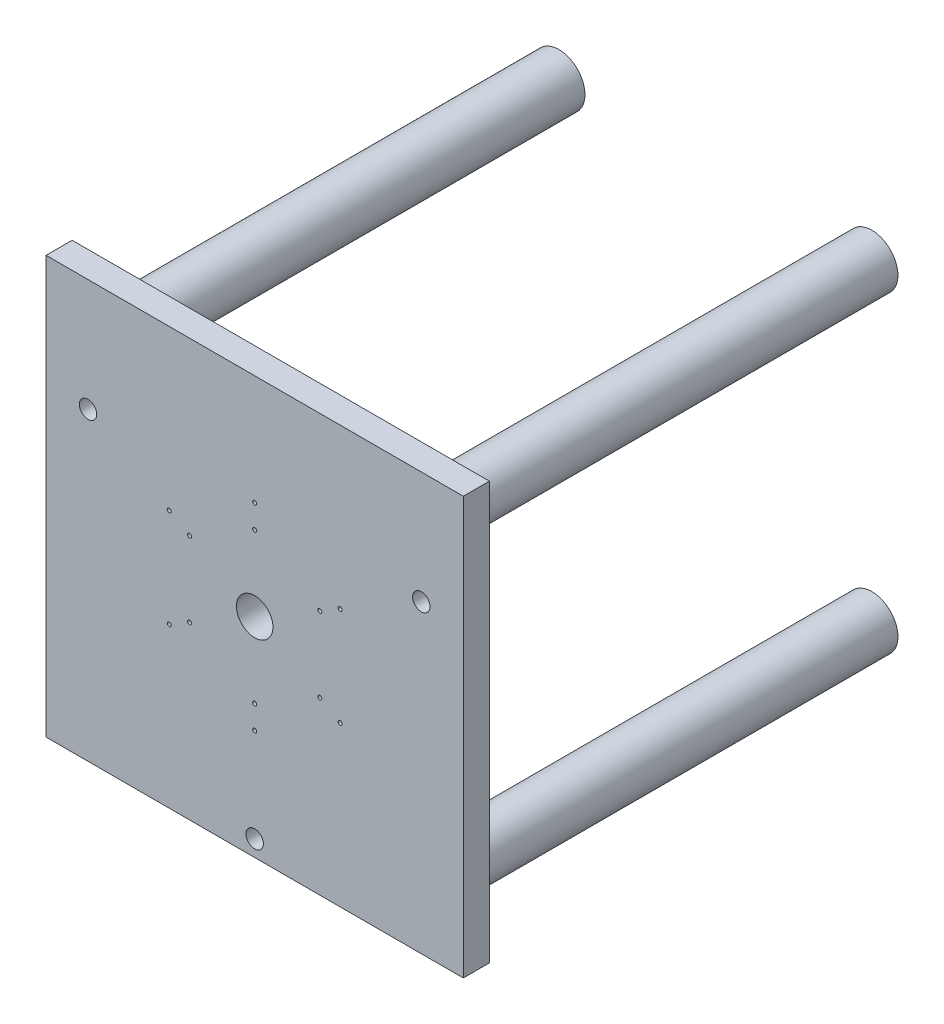
ISO-10303-21;
HEADER;
FILE_DESCRIPTION(('STEP AP214'),'2;1');
FILE_NAME('part.step','',(''),(''),'','','');
FILE_SCHEMA(('AUTOMOTIVE_DESIGN { 1 0 10303 214 1 1 1 1 }'));
ENDSEC;
DATA;
#1=APPLICATION_CONTEXT('core data for automotive mechanical design processes');
#2=APPLICATION_PROTOCOL_DEFINITION('international standard','automotive_design',2000,#1);
#3=PRODUCT_CONTEXT('',#1,'mechanical');
#4=PRODUCT('Part','Part','',(#3));
#5=PRODUCT_RELATED_PRODUCT_CATEGORY('part','',(#4));
#6=PRODUCT_DEFINITION_FORMATION('','',#4);
#7=PRODUCT_DEFINITION_CONTEXT('part definition',#1,'design');
#8=PRODUCT_DEFINITION('design','',#6,#7);
#9=PRODUCT_DEFINITION_SHAPE('','',#8);
#10=(LENGTH_UNIT() NAMED_UNIT(*) SI_UNIT(.MILLI.,.METRE.));
#11=(NAMED_UNIT(*) PLANE_ANGLE_UNIT() SI_UNIT($,.RADIAN.));
#12=(NAMED_UNIT(*) SI_UNIT($,.STERADIAN.) SOLID_ANGLE_UNIT());
#13=UNCERTAINTY_MEASURE_WITH_UNIT(LENGTH_MEASURE(1.E-05),#10,'distance_accuracy_value','');
#14=(GEOMETRIC_REPRESENTATION_CONTEXT(3) GLOBAL_UNCERTAINTY_ASSIGNED_CONTEXT((#13)) GLOBAL_UNIT_ASSIGNED_CONTEXT((#10,
#11,#12)) REPRESENTATION_CONTEXT('',''));
#15=CARTESIAN_POINT('',(0.,0.,0.));
#16=DIRECTION('',(0.,0.,1.));
#17=DIRECTION('',(1.,0.,0.));
#18=AXIS2_PLACEMENT_3D('',#15,#16,#17);
#19=CARTESIAN_POINT('',(0.,0.,15.));
#20=DIRECTION('',(0.,0.,1.));
#21=DIRECTION('',(1.,0.,0.));
#22=AXIS2_PLACEMENT_3D('',#19,#20,#21);
#23=PLANE('',#22);
#24=CARTESIAN_POINT('',(0.,-110.68,15.));
#25=DIRECTION('',(0.,0.,1.));
#26=DIRECTION('',(1.,0.,0.));
#27=AXIS2_PLACEMENT_3D('',#24,#25,#26);
#28=CIRCLE('',#27,5.);
#29=CARTESIAN_POINT('',(5.00000000000002,-110.68,15.));
#30=VERTEX_POINT('',#29);
#31=EDGE_CURVE('E200',#30,#30,#28,.T.);
#32=ORIENTED_EDGE('',*,*,#31,.F.);
#33=EDGE_LOOP('',(#32));
#34=FACE_BOUND('',#33,.T.);
#35=CARTESIAN_POINT('',(-95.8516916908614,55.3400000000004,15.));
#36=DIRECTION('',(0.,0.,1.));
#37=DIRECTION('',(1.,0.,0.));
#38=AXIS2_PLACEMENT_3D('',#35,#36,#37);
#39=CIRCLE('',#38,5.00000000000001);
#40=CARTESIAN_POINT('',(-90.8516916908614,55.3400000000004,15.));
#41=VERTEX_POINT('',#40);
#42=EDGE_CURVE('E683',#41,#41,#39,.T.);
#43=ORIENTED_EDGE('',*,*,#42,.F.);
#44=EDGE_LOOP('',(#43));
#45=FACE_BOUND('',#44,.T.);
#46=CARTESIAN_POINT('',(95.8516916908614,55.3400000000005,15.));
#47=DIRECTION('',(0.,0.,1.));
#48=DIRECTION('',(1.,0.,0.));
#49=AXIS2_PLACEMENT_3D('',#46,#47,#48);
#50=CIRCLE('',#49,5.00000000000001);
#51=CARTESIAN_POINT('',(100.851691690861,55.3400000000005,15.));
#52=VERTEX_POINT('',#51);
#53=EDGE_CURVE('E687',#52,#52,#50,.T.);
#54=ORIENTED_EDGE('',*,*,#53,.F.);
#55=EDGE_LOOP('',(#54));
#56=FACE_BOUND('',#55,.T.);
#57=CARTESIAN_POINT('',(-49.1469416647659,28.3750000000008,15.));
#58=DIRECTION('',(0.,0.,-1.));
#59=DIRECTION('',(-1.,0.,0.));
#60=AXIS2_PLACEMENT_3D('',#57,#58,#59);
#61=CIRCLE('',#60,1.15000000000001);
#62=CARTESIAN_POINT('',(-50.2969416647659,28.3750000000008,15.));
#63=VERTEX_POINT('',#62);
#64=EDGE_CURVE('E207',#63,#63,#61,.T.);
#65=ORIENTED_EDGE('',*,*,#64,.T.);
#66=EDGE_LOOP('',(#65));
#67=FACE_BOUND('',#66,.T.);
#68=CARTESIAN_POINT('',(-37.4555987136761,-21.6250000000006,15.));
#69=DIRECTION('',(0.,0.,1.));
#70=DIRECTION('',(-1.,0.,0.));
#71=AXIS2_PLACEMENT_3D('',#68,#69,#70);
#72=CIRCLE('',#71,1.15);
#73=CARTESIAN_POINT('',(-38.6055987136761,-21.6250000000006,15.));
#74=VERTEX_POINT('',#73);
#75=EDGE_CURVE('E181',#74,#74,#72,.T.);
#76=ORIENTED_EDGE('',*,*,#75,.F.);
#77=EDGE_LOOP('',(#76));
#78=FACE_BOUND('',#77,.T.);
#79=CARTESIAN_POINT('',(-49.1469416647659,-28.3750000000008,15.));
#80=DIRECTION('',(0.,0.,1.));
#81=DIRECTION('',(-1.,0.,0.));
#82=AXIS2_PLACEMENT_3D('',#79,#80,#81);
#83=CIRCLE('',#82,1.15000000000001);
#84=CARTESIAN_POINT('',(-50.2969416647659,-28.3750000000008,15.));
#85=VERTEX_POINT('',#84);
#86=EDGE_CURVE('E195',#85,#85,#83,.T.);
#87=ORIENTED_EDGE('',*,*,#86,.F.);
#88=EDGE_LOOP('',(#87));
#89=FACE_BOUND('',#88,.T.);
#90=CARTESIAN_POINT('',(37.4555987136761,-21.6250000000006,15.));
#91=DIRECTION('',(0.,0.,-1.));
#92=DIRECTION('',(1.,0.,0.));
#93=AXIS2_PLACEMENT_3D('',#90,#91,#92);
#94=CIRCLE('',#93,1.15);
#95=CARTESIAN_POINT('',(38.6055987136761,-21.6250000000006,15.));
#96=VERTEX_POINT('',#95);
#97=EDGE_CURVE('E163',#96,#96,#94,.T.);
#98=ORIENTED_EDGE('',*,*,#97,.T.);
#99=EDGE_LOOP('',(#98));
#100=FACE_BOUND('',#99,.T.);
#101=CARTESIAN_POINT('',(49.1469416647659,-28.3750000000008,15.));
#102=DIRECTION('',(0.,0.,-1.));
#103=DIRECTION('',(1.,0.,0.));
#104=AXIS2_PLACEMENT_3D('',#101,#102,#103);
#105=CIRCLE('',#104,1.15000000000001);
#106=CARTESIAN_POINT('',(50.2969416647659,-28.3750000000008,15.));
#107=VERTEX_POINT('',#106);
#108=EDGE_CURVE('E229',#107,#107,#105,.T.);
#109=ORIENTED_EDGE('',*,*,#108,.T.);
#110=EDGE_LOOP('',(#109));
#111=FACE_BOUND('',#110,.T.);
#112=CARTESIAN_POINT('',(-9.2433005693948E-13,-43.2499999999995,15.));
#113=DIRECTION('',(0.,0.,-1.));
#114=DIRECTION('',(1.,0.,0.));
#115=AXIS2_PLACEMENT_3D('',#112,#113,#114);
#116=CIRCLE('',#115,1.14999999999999);
#117=CARTESIAN_POINT('',(1.14999999999906,-43.2499999999995,15.));
#118=VERTEX_POINT('',#117);
#119=EDGE_CURVE('E233',#118,#118,#116,.T.);
#120=ORIENTED_EDGE('',*,*,#119,.T.);
#121=EDGE_LOOP('',(#120));
#122=FACE_BOUND('',#121,.T.);
#123=CARTESIAN_POINT('',(-1.21284926546395E-12,-56.7499999999995,15.));
#124=DIRECTION('',(0.,0.,-1.));
#125=DIRECTION('',(1.,0.,0.));
#126=AXIS2_PLACEMENT_3D('',#123,#124,#125);
#127=CIRCLE('',#126,1.15);
#128=CARTESIAN_POINT('',(1.14999999999878,-56.7499999999995,15.));
#129=VERTEX_POINT('',#128);
#130=EDGE_CURVE('E185',#129,#129,#127,.T.);
#131=ORIENTED_EDGE('',*,*,#130,.T.);
#132=EDGE_LOOP('',(#131));
#133=FACE_BOUND('',#132,.T.);
#134=CARTESIAN_POINT('',(37.4555987136761,21.6250000000006,15.));
#135=DIRECTION('',(0.,0.,1.));
#136=DIRECTION('',(1.,0.,0.));
#137=AXIS2_PLACEMENT_3D('',#134,#135,#136);
#138=CIRCLE('',#137,1.15);
#139=CARTESIAN_POINT('',(38.6055987136761,21.6250000000006,15.));
#140=VERTEX_POINT('',#139);
#141=EDGE_CURVE('E146',#140,#140,#138,.T.);
#142=ORIENTED_EDGE('',*,*,#141,.F.);
#143=EDGE_LOOP('',(#142));
#144=FACE_BOUND('',#143,.T.);
#145=CARTESIAN_POINT('',(49.1469416647659,28.3750000000008,15.));
#146=DIRECTION('',(0.,0.,1.));
#147=DIRECTION('',(1.,0.,0.));
#148=AXIS2_PLACEMENT_3D('',#145,#146,#147);
#149=CIRCLE('',#148,1.15000000000001);
#150=CARTESIAN_POINT('',(50.2969416647659,28.3750000000008,15.));
#151=VERTEX_POINT('',#150);
#152=EDGE_CURVE('E243',#151,#151,#149,.T.);
#153=ORIENTED_EDGE('',*,*,#152,.F.);
#154=EDGE_LOOP('',(#153));
#155=FACE_BOUND('',#154,.T.);
#156=CARTESIAN_POINT('',(-9.2433005693948E-13,43.2499999999995,15.));
#157=DIRECTION('',(0.,0.,1.));
#158=DIRECTION('',(1.,0.,0.));
#159=AXIS2_PLACEMENT_3D('',#156,#157,#158);
#160=CIRCLE('',#159,1.14999999999999);
#161=CARTESIAN_POINT('',(1.14999999999906,43.2499999999995,15.));
#162=VERTEX_POINT('',#161);
#163=EDGE_CURVE('E247',#162,#162,#160,.T.);
#164=ORIENTED_EDGE('',*,*,#163,.F.);
#165=EDGE_LOOP('',(#164));
#166=FACE_BOUND('',#165,.T.);
#167=CARTESIAN_POINT('',(-1.21284926546395E-12,56.7499999999995,15.));
#168=DIRECTION('',(0.,0.,1.));
#169=DIRECTION('',(1.,0.,0.));
#170=AXIS2_PLACEMENT_3D('',#167,#168,#169);
#171=CIRCLE('',#170,1.15);
#172=CARTESIAN_POINT('',(1.14999999999878,56.7499999999995,15.));
#173=VERTEX_POINT('',#172);
#174=EDGE_CURVE('E175',#173,#173,#171,.T.);
#175=ORIENTED_EDGE('',*,*,#174,.F.);
#176=EDGE_LOOP('',(#175));
#177=FACE_BOUND('',#176,.T.);
#178=CARTESIAN_POINT('',(0.,0.,15.));
#179=DIRECTION('',(0.,0.,1.));
#180=DIRECTION('',(1.,0.,0.));
#181=AXIS2_PLACEMENT_3D('',#178,#179,#180);
#182=CIRCLE('',#181,10.5);
#183=CARTESIAN_POINT('',(10.5,0.,15.));
#184=VERTEX_POINT('',#183);
#185=EDGE_CURVE('E140',#184,#184,#182,.T.);
#186=ORIENTED_EDGE('',*,*,#185,.F.);
#187=EDGE_LOOP('',(#186));
#188=FACE_BOUND('',#187,.T.);
#189=DIRECTION('',(0.,1.,0.));
#190=VECTOR('',#189,1.);
#191=CARTESIAN_POINT('',(120.,120.,15.));
#192=LINE('',#191,#190);
#193=CARTESIAN_POINT('',(120.,-120.,15.));
#194=VERTEX_POINT('',#193);
#195=CARTESIAN_POINT('',(120.,120.,15.));
#196=VERTEX_POINT('',#195);
#197=EDGE_CURVE('E96',#194,#196,#192,.T.);
#198=ORIENTED_EDGE('',*,*,#197,.T.);
#199=DIRECTION('',(-1.,0.,0.));
#200=VECTOR('',#199,1.);
#201=CARTESIAN_POINT('',(-120.,120.,15.));
#202=LINE('',#201,#200);
#203=CARTESIAN_POINT('',(-120.,120.,15.));
#204=VERTEX_POINT('',#203);
#205=EDGE_CURVE('E91',#196,#204,#202,.T.);
#206=ORIENTED_EDGE('',*,*,#205,.T.);
#207=DIRECTION('',(0.,-1.,0.));
#208=VECTOR('',#207,1.);
#209=CARTESIAN_POINT('',(-120.,120.,15.));
#210=LINE('',#209,#208);
#211=CARTESIAN_POINT('',(-120.,-120.,15.));
#212=VERTEX_POINT('',#211);
#213=EDGE_CURVE('E94',#204,#212,#210,.T.);
#214=ORIENTED_EDGE('',*,*,#213,.T.);
#215=DIRECTION('',(1.,0.,0.));
#216=VECTOR('',#215,1.);
#217=CARTESIAN_POINT('',(-120.,-120.,15.));
#218=LINE('',#217,#216);
#219=EDGE_CURVE('E60',#212,#194,#218,.T.);
#220=ORIENTED_EDGE('',*,*,#219,.T.);
#221=EDGE_LOOP('',(#198,#206,#214,#220));
#222=FACE_BOUND('',#221,.T.);
#223=CARTESIAN_POINT('',(-37.4555987136761,21.6250000000006,15.));
#224=DIRECTION('',(0.,0.,-1.));
#225=DIRECTION('',(-1.,0.,0.));
#226=AXIS2_PLACEMENT_3D('',#223,#224,#225);
#227=CIRCLE('',#226,1.15);
#228=CARTESIAN_POINT('',(-38.6055987136761,21.6250000000006,15.));
#229=VERTEX_POINT('',#228);
#230=EDGE_CURVE('E191',#229,#229,#227,.T.);
#231=ORIENTED_EDGE('',*,*,#230,.T.);
#232=EDGE_LOOP('',(#231));
#233=FACE_BOUND('',#232,.T.);
#234=ADVANCED_FACE('F40',(#34,#45,#56,#67,#78,#89,#100,#111,#122,#133,#144,#155,#166,#177,#188,
#222,#233),#23,.T.);
#235=CARTESIAN_POINT('',(0.,0.,0.));
#236=DIRECTION('',(0.,0.,1.));
#237=DIRECTION('',(1.,0.,0.));
#238=AXIS2_PLACEMENT_3D('',#235,#236,#237);
#239=PLANE('',#238);
#240=CARTESIAN_POINT('',(0.,-110.68,0.));
#241=DIRECTION('',(0.,0.,1.));
#242=DIRECTION('',(1.,0.,0.));
#243=AXIS2_PLACEMENT_3D('',#240,#241,#242);
#244=CIRCLE('',#243,5.);
#245=CARTESIAN_POINT('',(5.00000000000002,-110.68,0.));
#246=VERTEX_POINT('',#245);
#247=EDGE_CURVE('E44',#246,#246,#244,.T.);
#248=ORIENTED_EDGE('',*,*,#247,.T.);
#249=EDGE_LOOP('',(#248));
#250=FACE_BOUND('',#249,.T.);
#251=CARTESIAN_POINT('',(-95.8516916908614,55.3400000000004,0.));
#252=DIRECTION('',(0.,0.,1.));
#253=DIRECTION('',(1.,0.,0.));
#254=AXIS2_PLACEMENT_3D('',#251,#252,#253);
#255=CIRCLE('',#254,5.00000000000001);
#256=CARTESIAN_POINT('',(-90.8516916908614,55.3400000000004,0.));
#257=VERTEX_POINT('',#256);
#258=EDGE_CURVE('E199',#257,#257,#255,.T.);
#259=ORIENTED_EDGE('',*,*,#258,.T.);
#260=EDGE_LOOP('',(#259));
#261=FACE_BOUND('',#260,.T.);
#262=CARTESIAN_POINT('',(95.8516916908614,55.3400000000005,0.));
#263=DIRECTION('',(0.,0.,1.));
#264=DIRECTION('',(1.,0.,0.));
#265=AXIS2_PLACEMENT_3D('',#262,#263,#264);
#266=CIRCLE('',#265,5.00000000000001);
#267=CARTESIAN_POINT('',(100.851691690861,55.3400000000005,0.));
#268=VERTEX_POINT('',#267);
#269=EDGE_CURVE('E196',#268,#268,#266,.T.);
#270=ORIENTED_EDGE('',*,*,#269,.T.);
#271=EDGE_LOOP('',(#270));
#272=FACE_BOUND('',#271,.T.);
#273=CARTESIAN_POINT('',(-37.4555987136761,-21.6250000000006,0.));
#274=DIRECTION('',(0.,0.,1.));
#275=DIRECTION('',(1.,0.,0.));
#276=AXIS2_PLACEMENT_3D('',#273,#274,#275);
#277=CIRCLE('',#276,1.15);
#278=CARTESIAN_POINT('',(-36.3055987136761,-21.6250000000006,0.));
#279=VERTEX_POINT('',#278);
#280=EDGE_CURVE('E180',#279,#279,#277,.T.);
#281=ORIENTED_EDGE('',*,*,#280,.T.);
#282=EDGE_LOOP('',(#281));
#283=FACE_BOUND('',#282,.T.);
#284=CARTESIAN_POINT('',(-49.1469416647659,-28.3750000000008,0.));
#285=DIRECTION('',(0.,0.,1.));
#286=DIRECTION('',(1.,0.,0.));
#287=AXIS2_PLACEMENT_3D('',#284,#285,#286);
#288=CIRCLE('',#287,1.15000000000001);
#289=CARTESIAN_POINT('',(-47.9969416647658,-28.3750000000008,0.));
#290=VERTEX_POINT('',#289);
#291=EDGE_CURVE('E176',#290,#290,#288,.T.);
#292=ORIENTED_EDGE('',*,*,#291,.T.);
#293=EDGE_LOOP('',(#292));
#294=FACE_BOUND('',#293,.T.);
#295=CARTESIAN_POINT('',(37.4555987136761,-21.6250000000006,0.));
#296=DIRECTION('',(0.,0.,1.));
#297=DIRECTION('',(1.,0.,0.));
#298=AXIS2_PLACEMENT_3D('',#295,#296,#297);
#299=CIRCLE('',#298,1.15);
#300=CARTESIAN_POINT('',(38.6055987136761,-21.6250000000006,0.));
#301=VERTEX_POINT('',#300);
#302=EDGE_CURVE('E171',#301,#301,#299,.F.);
#303=ORIENTED_EDGE('',*,*,#302,.F.);
#304=EDGE_LOOP('',(#303));
#305=FACE_BOUND('',#304,.T.);
#306=CARTESIAN_POINT('',(49.1469416647659,-28.3750000000008,0.));
#307=DIRECTION('',(0.,0.,1.));
#308=DIRECTION('',(1.,0.,0.));
#309=AXIS2_PLACEMENT_3D('',#306,#307,#308);
#310=CIRCLE('',#309,1.15000000000001);
#311=CARTESIAN_POINT('',(50.2969416647659,-28.3750000000008,0.));
#312=VERTEX_POINT('',#311);
#313=EDGE_CURVE('E167',#312,#312,#310,.F.);
#314=ORIENTED_EDGE('',*,*,#313,.F.);
#315=EDGE_LOOP('',(#314));
#316=FACE_BOUND('',#315,.T.);
#317=CARTESIAN_POINT('',(-9.2433005693948E-13,-43.2499999999995,0.));
#318=DIRECTION('',(0.,0.,1.));
#319=DIRECTION('',(1.,0.,0.));
#320=AXIS2_PLACEMENT_3D('',#317,#318,#319);
#321=CIRCLE('',#320,1.14999999999999);
#322=CARTESIAN_POINT('',(1.14999999999906,-43.2499999999995,0.));
#323=VERTEX_POINT('',#322);
#324=EDGE_CURVE('E162',#323,#323,#321,.F.);
#325=ORIENTED_EDGE('',*,*,#324,.F.);
#326=EDGE_LOOP('',(#325));
#327=FACE_BOUND('',#326,.T.);
#328=CARTESIAN_POINT('',(-1.21284926546395E-12,-56.7499999999995,0.));
#329=DIRECTION('',(0.,0.,1.));
#330=DIRECTION('',(1.,0.,0.));
#331=AXIS2_PLACEMENT_3D('',#328,#329,#330);
#332=CIRCLE('',#331,1.15);
#333=CARTESIAN_POINT('',(1.14999999999878,-56.7499999999995,0.));
#334=VERTEX_POINT('',#333);
#335=EDGE_CURVE('E158',#334,#334,#332,.F.);
#336=ORIENTED_EDGE('',*,*,#335,.F.);
#337=EDGE_LOOP('',(#336));
#338=FACE_BOUND('',#337,.T.);
#339=CARTESIAN_POINT('',(37.4555987136761,21.6250000000006,0.));
#340=DIRECTION('',(0.,0.,1.));
#341=DIRECTION('',(1.,0.,0.));
#342=AXIS2_PLACEMENT_3D('',#339,#340,#341);
#343=CIRCLE('',#342,1.15);
#344=CARTESIAN_POINT('',(38.6055987136761,21.6250000000006,0.));
#345=VERTEX_POINT('',#344);
#346=EDGE_CURVE('E154',#345,#345,#343,.T.);
#347=ORIENTED_EDGE('',*,*,#346,.T.);
#348=EDGE_LOOP('',(#347));
#349=FACE_BOUND('',#348,.T.);
#350=CARTESIAN_POINT('',(49.1469416647659,28.3750000000008,0.));
#351=DIRECTION('',(0.,0.,1.));
#352=DIRECTION('',(1.,0.,0.));
#353=AXIS2_PLACEMENT_3D('',#350,#351,#352);
#354=CIRCLE('',#353,1.15000000000001);
#355=CARTESIAN_POINT('',(50.2969416647659,28.3750000000008,0.));
#356=VERTEX_POINT('',#355);
#357=EDGE_CURVE('E150',#356,#356,#354,.T.);
#358=ORIENTED_EDGE('',*,*,#357,.T.);
#359=EDGE_LOOP('',(#358));
#360=FACE_BOUND('',#359,.T.);
#361=CARTESIAN_POINT('',(-9.2433005693948E-13,43.2499999999995,0.));
#362=DIRECTION('',(0.,0.,1.));
#363=DIRECTION('',(1.,0.,0.));
#364=AXIS2_PLACEMENT_3D('',#361,#362,#363);
#365=CIRCLE('',#364,1.14999999999999);
#366=CARTESIAN_POINT('',(1.14999999999906,43.2499999999995,0.));
#367=VERTEX_POINT('',#366);
#368=EDGE_CURVE('E145',#367,#367,#365,.T.);
#369=ORIENTED_EDGE('',*,*,#368,.T.);
#370=EDGE_LOOP('',(#369));
#371=FACE_BOUND('',#370,.T.);
#372=CARTESIAN_POINT('',(-1.21284926546395E-12,56.7499999999995,0.));
#373=DIRECTION('',(0.,0.,1.));
#374=DIRECTION('',(1.,0.,0.));
#375=AXIS2_PLACEMENT_3D('',#372,#373,#374);
#376=CIRCLE('',#375,1.15);
#377=CARTESIAN_POINT('',(1.14999999999878,56.7499999999995,0.));
#378=VERTEX_POINT('',#377);
#379=EDGE_CURVE('E141',#378,#378,#376,.T.);
#380=ORIENTED_EDGE('',*,*,#379,.T.);
#381=EDGE_LOOP('',(#380));
#382=FACE_BOUND('',#381,.T.);
#383=CARTESIAN_POINT('',(0.,0.,0.));
#384=DIRECTION('',(0.,0.,1.));
#385=DIRECTION('',(1.,0.,0.));
#386=AXIS2_PLACEMENT_3D('',#383,#384,#385);
#387=CIRCLE('',#386,10.5);
#388=CARTESIAN_POINT('',(10.5,0.,0.));
#389=VERTEX_POINT('',#388);
#390=EDGE_CURVE('E135',#389,#389,#387,.T.);
#391=ORIENTED_EDGE('',*,*,#390,.T.);
#392=EDGE_LOOP('',(#391));
#393=FACE_BOUND('',#392,.T.);
#394=CARTESIAN_POINT('',(90.,90.,0.));
#395=DIRECTION('',(0.,0.,1.));
#396=DIRECTION('',(1.,0.,0.));
#397=AXIS2_PLACEMENT_3D('',#394,#395,#396);
#398=CIRCLE('',#397,15.);
#399=CARTESIAN_POINT('',(105.,90.,0.));
#400=VERTEX_POINT('',#399);
#401=EDGE_CURVE('E11',#400,#400,#398,.F.);
#402=ORIENTED_EDGE('',*,*,#401,.F.);
#403=EDGE_LOOP('',(#402));
#404=FACE_BOUND('',#403,.T.);
#405=CARTESIAN_POINT('',(90.,-90.,0.));
#406=DIRECTION('',(0.,0.,1.));
#407=DIRECTION('',(1.,0.,0.));
#408=AXIS2_PLACEMENT_3D('',#405,#406,#407);
#409=CIRCLE('',#408,15.);
#410=CARTESIAN_POINT('',(105.,-90.,0.));
#411=VERTEX_POINT('',#410);
#412=EDGE_CURVE('E260',#411,#411,#409,.T.);
#413=ORIENTED_EDGE('',*,*,#412,.T.);
#414=EDGE_LOOP('',(#413));
#415=FACE_BOUND('',#414,.T.);
#416=CARTESIAN_POINT('',(-90.,90.,0.));
#417=DIRECTION('',(0.,0.,1.));
#418=DIRECTION('',(-1.,0.,0.));
#419=AXIS2_PLACEMENT_3D('',#416,#417,#418);
#420=CIRCLE('',#419,15.);
#421=CARTESIAN_POINT('',(-105.,90.,0.));
#422=VERTEX_POINT('',#421);
#423=EDGE_CURVE('E265',#422,#422,#420,.T.);
#424=ORIENTED_EDGE('',*,*,#423,.T.);
#425=EDGE_LOOP('',(#424));
#426=FACE_BOUND('',#425,.T.);
#427=CARTESIAN_POINT('',(-90.,-90.,0.));
#428=DIRECTION('',(0.,0.,1.));
#429=DIRECTION('',(1.,0.,0.));
#430=AXIS2_PLACEMENT_3D('',#427,#428,#429);
#431=CIRCLE('',#430,15.);
#432=CARTESIAN_POINT('',(-75.,-90.,0.));
#433=VERTEX_POINT('',#432);
#434=EDGE_CURVE('E51',#433,#433,#431,.F.);
#435=ORIENTED_EDGE('',*,*,#434,.F.);
#436=EDGE_LOOP('',(#435));
#437=FACE_BOUND('',#436,.T.);
#438=DIRECTION('',(0.,1.,0.));
#439=VECTOR('',#438,1.);
#440=CARTESIAN_POINT('',(120.,120.,0.));
#441=LINE('',#440,#439);
#442=CARTESIAN_POINT('',(120.,-120.,0.));
#443=VERTEX_POINT('',#442);
#444=CARTESIAN_POINT('',(120.,120.,0.));
#445=VERTEX_POINT('',#444);
#446=EDGE_CURVE('E115',#443,#445,#441,.T.);
#447=ORIENTED_EDGE('',*,*,#446,.F.);
#448=DIRECTION('',(1.,0.,0.));
#449=VECTOR('',#448,1.);
#450=CARTESIAN_POINT('',(-120.,-120.,0.));
#451=LINE('',#450,#449);
#452=CARTESIAN_POINT('',(-120.,-120.,0.));
#453=VERTEX_POINT('',#452);
#454=EDGE_CURVE('E83',#453,#443,#451,.T.);
#455=ORIENTED_EDGE('',*,*,#454,.F.);
#456=DIRECTION('',(0.,-1.,0.));
#457=VECTOR('',#456,1.);
#458=CARTESIAN_POINT('',(-120.,120.,0.));
#459=LINE('',#458,#457);
#460=CARTESIAN_POINT('',(-120.,120.,0.));
#461=VERTEX_POINT('',#460);
#462=EDGE_CURVE('E77',#461,#453,#459,.T.);
#463=ORIENTED_EDGE('',*,*,#462,.F.);
#464=DIRECTION('',(-1.,0.,0.));
#465=VECTOR('',#464,1.);
#466=CARTESIAN_POINT('',(-120.,120.,0.));
#467=LINE('',#466,#465);
#468=EDGE_CURVE('E102',#445,#461,#467,.T.);
#469=ORIENTED_EDGE('',*,*,#468,.F.);
#470=EDGE_LOOP('',(#447,#455,#463,#469));
#471=FACE_BOUND('',#470,.T.);
#472=CARTESIAN_POINT('',(-49.1469416647659,28.3750000000008,0.));
#473=DIRECTION('',(0.,0.,1.));
#474=DIRECTION('',(1.,0.,0.));
#475=AXIS2_PLACEMENT_3D('',#472,#473,#474);
#476=CIRCLE('',#475,1.15000000000001);
#477=CARTESIAN_POINT('',(-47.9969416647658,28.3750000000008,0.));
#478=VERTEX_POINT('',#477);
#479=EDGE_CURVE('E186',#478,#478,#476,.F.);
#480=ORIENTED_EDGE('',*,*,#479,.F.);
#481=EDGE_LOOP('',(#480));
#482=FACE_BOUND('',#481,.T.);
#483=CARTESIAN_POINT('',(-37.4555987136761,21.6250000000006,0.));
#484=DIRECTION('',(0.,0.,1.));
#485=DIRECTION('',(1.,0.,0.));
#486=AXIS2_PLACEMENT_3D('',#483,#484,#485);
#487=CIRCLE('',#486,1.15);
#488=CARTESIAN_POINT('',(-36.3055987136761,21.6250000000006,0.));
#489=VERTEX_POINT('',#488);
#490=EDGE_CURVE('E190',#489,#489,#487,.F.);
#491=ORIENTED_EDGE('',*,*,#490,.F.);
#492=EDGE_LOOP('',(#491));
#493=FACE_BOUND('',#492,.T.);
#494=ADVANCED_FACE('F290',(#250,#261,#272,#283,#294,#305,#316,#327,#338,#349,#360,#371,#382,
#393,#404,#415,#426,#437,#471,#482,#493),#239,.F.);
#495=CARTESIAN_POINT('',(120.,120.,15.));
#496=DIRECTION('',(-1.,0.,0.));
#497=DIRECTION('',(0.,-1.,0.));
#498=AXIS2_PLACEMENT_3D('',#495,#496,#497);
#499=PLANE('',#498);
#500=ORIENTED_EDGE('',*,*,#446,.T.);
#501=DIRECTION('',(0.,0.,-1.));
#502=VECTOR('',#501,1.);
#503=CARTESIAN_POINT('',(120.,120.,15.));
#504=LINE('',#503,#502);
#505=EDGE_CURVE('E104',#196,#445,#504,.T.);
#506=ORIENTED_EDGE('',*,*,#505,.F.);
#507=ORIENTED_EDGE('',*,*,#197,.F.);
#508=DIRECTION('',(0.,0.,-1.));
#509=VECTOR('',#508,1.);
#510=CARTESIAN_POINT('',(120.,-120.,15.));
#511=LINE('',#510,#509);
#512=EDGE_CURVE('E111',#194,#443,#511,.T.);
#513=ORIENTED_EDGE('',*,*,#512,.T.);
#514=EDGE_LOOP('',(#500,#506,#507,#513));
#515=FACE_BOUND('',#514,.T.);
#516=ADVANCED_FACE('F42',(#515),#499,.F.);
#517=CARTESIAN_POINT('',(-120.,120.,15.));
#518=DIRECTION('',(0.,-1.,0.));
#519=DIRECTION('',(0.,0.,-1.));
#520=AXIS2_PLACEMENT_3D('',#517,#518,#519);
#521=PLANE('',#520);
#522=ORIENTED_EDGE('',*,*,#468,.T.);
#523=DIRECTION('',(0.,0.,-1.));
#524=VECTOR('',#523,1.);
#525=CARTESIAN_POINT('',(-120.,120.,15.));
#526=LINE('',#525,#524);
#527=EDGE_CURVE('E100',#204,#461,#526,.T.);
#528=ORIENTED_EDGE('',*,*,#527,.F.);
#529=ORIENTED_EDGE('',*,*,#205,.F.);
#530=ORIENTED_EDGE('',*,*,#505,.T.);
#531=EDGE_LOOP('',(#522,#528,#529,#530));
#532=FACE_BOUND('',#531,.T.);
#533=ADVANCED_FACE('F101',(#532),#521,.F.);
#534=CARTESIAN_POINT('',(-120.,120.,15.));
#535=DIRECTION('',(1.,0.,0.));
#536=DIRECTION('',(0.,1.,0.));
#537=AXIS2_PLACEMENT_3D('',#534,#535,#536);
#538=PLANE('',#537);
#539=ORIENTED_EDGE('',*,*,#462,.T.);
#540=DIRECTION('',(0.,0.,-1.));
#541=VECTOR('',#540,1.);
#542=CARTESIAN_POINT('',(-120.,-120.,15.));
#543=LINE('',#542,#541);
#544=EDGE_CURVE('E105',#212,#453,#543,.T.);
#545=ORIENTED_EDGE('',*,*,#544,.F.);
#546=ORIENTED_EDGE('',*,*,#213,.F.);
#547=ORIENTED_EDGE('',*,*,#527,.T.);
#548=EDGE_LOOP('',(#539,#545,#546,#547));
#549=FACE_BOUND('',#548,.T.);
#550=ADVANCED_FACE('F107',(#549),#538,.F.);
#551=CARTESIAN_POINT('',(-120.,-120.,15.));
#552=DIRECTION('',(0.,1.,0.));
#553=DIRECTION('',(0.,0.,1.));
#554=AXIS2_PLACEMENT_3D('',#551,#552,#553);
#555=PLANE('',#554);
#556=ORIENTED_EDGE('',*,*,#454,.T.);
#557=ORIENTED_EDGE('',*,*,#512,.F.);
#558=ORIENTED_EDGE('',*,*,#219,.F.);
#559=ORIENTED_EDGE('',*,*,#544,.T.);
#560=EDGE_LOOP('',(#556,#557,#558,#559));
#561=FACE_BOUND('',#560,.T.);
#562=ADVANCED_FACE('F286',(#561),#555,.F.);
#563=CARTESIAN_POINT('',(-90.,-90.,-250.));
#564=DIRECTION('',(0.,0.,1.));
#565=DIRECTION('',(1.,0.,0.));
#566=AXIS2_PLACEMENT_3D('',#563,#564,#565);
#567=CYLINDRICAL_SURFACE('',#566,15.);
#568=CARTESIAN_POINT('',(-90.,-90.,-250.));
#569=DIRECTION('',(0.,0.,-1.));
#570=DIRECTION('',(-1.,0.,0.));
#571=AXIS2_PLACEMENT_3D('',#568,#569,#570);
#572=CIRCLE('',#571,15.);
#573=CARTESIAN_POINT('',(-105.,-90.,-250.));
#574=VERTEX_POINT('',#573);
#575=EDGE_CURVE('E119',#574,#574,#572,.T.);
#576=ORIENTED_EDGE('',*,*,#575,.F.);
#577=EDGE_LOOP('',(#576));
#578=FACE_BOUND('',#577,.T.);
#579=ORIENTED_EDGE('',*,*,#434,.T.);
#580=EDGE_LOOP('',(#579));
#581=FACE_BOUND('',#580,.T.);
#582=ADVANCED_FACE('F283',(#578,#581),#567,.T.);
#583=CARTESIAN_POINT('',(-90.,-90.,-250.));
#584=DIRECTION('',(0.,0.,-1.));
#585=DIRECTION('',(-1.,0.,0.));
#586=AXIS2_PLACEMENT_3D('',#583,#584,#585);
#587=PLANE('',#586);
#588=ORIENTED_EDGE('',*,*,#575,.T.);
#589=EDGE_LOOP('',(#588));
#590=FACE_BOUND('',#589,.T.);
#591=ADVANCED_FACE('F281',(#590),#587,.T.);
#592=CARTESIAN_POINT('',(-90.,90.,-250.));
#593=DIRECTION('',(0.,0.,1.));
#594=DIRECTION('',(1.,0.,0.));
#595=AXIS2_PLACEMENT_3D('',#592,#593,#594);
#596=CYLINDRICAL_SURFACE('',#595,15.);
#597=CARTESIAN_POINT('',(-90.,90.,-250.));
#598=DIRECTION('',(0.,0.,1.));
#599=DIRECTION('',(-1.,0.,0.));
#600=AXIS2_PLACEMENT_3D('',#597,#598,#599);
#601=CIRCLE('',#600,15.);
#602=CARTESIAN_POINT('',(-105.,90.,-250.));
#603=VERTEX_POINT('',#602);
#604=EDGE_CURVE('E269',#603,#603,#601,.T.);
#605=ORIENTED_EDGE('',*,*,#604,.T.);
#606=EDGE_LOOP('',(#605));
#607=FACE_BOUND('',#606,.T.);
#608=ORIENTED_EDGE('',*,*,#423,.F.);
#609=EDGE_LOOP('',(#608));
#610=FACE_BOUND('',#609,.T.);
#611=ADVANCED_FACE('F527',(#607,#610),#596,.T.);
#612=CARTESIAN_POINT('',(-90.,90.,-250.));
#613=DIRECTION('',(0.,0.,-1.));
#614=DIRECTION('',(-1.,0.,0.));
#615=AXIS2_PLACEMENT_3D('',#612,#613,#614);
#616=PLANE('',#615);
#617=ORIENTED_EDGE('',*,*,#604,.F.);
#618=EDGE_LOOP('',(#617));
#619=FACE_BOUND('',#618,.T.);
#620=ADVANCED_FACE('F517',(#619),#616,.T.);
#621=CARTESIAN_POINT('',(90.,-90.,-250.));
#622=DIRECTION('',(0.,0.,1.));
#623=DIRECTION('',(1.,0.,0.));
#624=AXIS2_PLACEMENT_3D('',#621,#622,#623);
#625=CYLINDRICAL_SURFACE('',#624,15.);
#626=CARTESIAN_POINT('',(90.,-90.,-250.));
#627=DIRECTION('',(0.,0.,1.));
#628=DIRECTION('',(1.,0.,0.));
#629=AXIS2_PLACEMENT_3D('',#626,#627,#628);
#630=CIRCLE('',#629,15.);
#631=CARTESIAN_POINT('',(105.,-90.,-250.));
#632=VERTEX_POINT('',#631);
#633=EDGE_CURVE('E261',#632,#632,#630,.T.);
#634=ORIENTED_EDGE('',*,*,#633,.T.);
#635=EDGE_LOOP('',(#634));
#636=FACE_BOUND('',#635,.T.);
#637=ORIENTED_EDGE('',*,*,#412,.F.);
#638=EDGE_LOOP('',(#637));
#639=FACE_BOUND('',#638,.T.);
#640=ADVANCED_FACE('F507',(#636,#639),#625,.T.);
#641=CARTESIAN_POINT('',(90.,-90.,-250.));
#642=DIRECTION('',(0.,0.,-1.));
#643=DIRECTION('',(1.,0.,0.));
#644=AXIS2_PLACEMENT_3D('',#641,#642,#643);
#645=PLANE('',#644);
#646=ORIENTED_EDGE('',*,*,#633,.F.);
#647=EDGE_LOOP('',(#646));
#648=FACE_BOUND('',#647,.T.);
#649=ADVANCED_FACE('F495',(#648),#645,.T.);
#650=CARTESIAN_POINT('',(90.,90.,-250.));
#651=DIRECTION('',(0.,0.,1.));
#652=DIRECTION('',(1.,0.,0.));
#653=AXIS2_PLACEMENT_3D('',#650,#651,#652);
#654=CYLINDRICAL_SURFACE('',#653,15.);
#655=CARTESIAN_POINT('',(90.,90.,-250.));
#656=DIRECTION('',(0.,0.,-1.));
#657=DIRECTION('',(1.,0.,0.));
#658=AXIS2_PLACEMENT_3D('',#655,#656,#657);
#659=CIRCLE('',#658,15.);
#660=CARTESIAN_POINT('',(105.,90.,-250.));
#661=VERTEX_POINT('',#660);
#662=EDGE_CURVE('E139',#661,#661,#659,.T.);
#663=ORIENTED_EDGE('',*,*,#662,.F.);
#664=EDGE_LOOP('',(#663));
#665=FACE_BOUND('',#664,.T.);
#666=ORIENTED_EDGE('',*,*,#401,.T.);
#667=EDGE_LOOP('',(#666));
#668=FACE_BOUND('',#667,.T.);
#669=ADVANCED_FACE('F483',(#665,#668),#654,.T.);
#670=CARTESIAN_POINT('',(90.,90.,-250.));
#671=DIRECTION('',(0.,0.,-1.));
#672=DIRECTION('',(1.,0.,0.));
#673=AXIS2_PLACEMENT_3D('',#670,#671,#672);
#674=PLANE('',#673);
#675=ORIENTED_EDGE('',*,*,#662,.T.);
#676=EDGE_LOOP('',(#675));
#677=FACE_BOUND('',#676,.T.);
#678=ADVANCED_FACE('F470',(#677),#674,.T.);
#679=CARTESIAN_POINT('',(0.,0.,-235.));
#680=DIRECTION('',(0.,0.,1.));
#681=DIRECTION('',(1.,0.,0.));
#682=AXIS2_PLACEMENT_3D('',#679,#680,#681);
#683=CYLINDRICAL_SURFACE('',#682,10.5);
#684=ORIENTED_EDGE('',*,*,#185,.T.);
#685=EDGE_LOOP('',(#684));
#686=FACE_BOUND('',#685,.T.);
#687=ORIENTED_EDGE('',*,*,#390,.F.);
#688=EDGE_LOOP('',(#687));
#689=FACE_BOUND('',#688,.T.);
#690=ADVANCED_FACE('F459',(#686,#689),#683,.F.);
#691=CARTESIAN_POINT('',(-1.21284926546395E-12,56.7499999999995,-25.));
#692=DIRECTION('',(0.,0.,1.));
#693=DIRECTION('',(1.,0.,0.));
#694=AXIS2_PLACEMENT_3D('',#691,#692,#693);
#695=CYLINDRICAL_SURFACE('',#694,1.15);
#696=ORIENTED_EDGE('',*,*,#174,.T.);
#697=EDGE_LOOP('',(#696));
#698=FACE_BOUND('',#697,.T.);
#699=ORIENTED_EDGE('',*,*,#379,.F.);
#700=EDGE_LOOP('',(#699));
#701=FACE_BOUND('',#700,.T.);
#702=ADVANCED_FACE('F449',(#698,#701),#695,.F.);
#703=CARTESIAN_POINT('',(-9.2433005693948E-13,43.2499999999995,-25.));
#704=DIRECTION('',(0.,0.,1.));
#705=DIRECTION('',(1.,0.,0.));
#706=AXIS2_PLACEMENT_3D('',#703,#704,#705);
#707=CYLINDRICAL_SURFACE('',#706,1.14999999999999);
#708=ORIENTED_EDGE('',*,*,#163,.T.);
#709=EDGE_LOOP('',(#708));
#710=FACE_BOUND('',#709,.T.);
#711=ORIENTED_EDGE('',*,*,#368,.F.);
#712=EDGE_LOOP('',(#711));
#713=FACE_BOUND('',#712,.T.);
#714=ADVANCED_FACE('F439',(#710,#713),#707,.F.);
#715=CARTESIAN_POINT('',(49.1469416647659,28.3750000000008,-25.));
#716=DIRECTION('',(0.,0.,1.));
#717=DIRECTION('',(1.,0.,0.));
#718=AXIS2_PLACEMENT_3D('',#715,#716,#717);
#719=CYLINDRICAL_SURFACE('',#718,1.15000000000001);
#720=ORIENTED_EDGE('',*,*,#152,.T.);
#721=EDGE_LOOP('',(#720));
#722=FACE_BOUND('',#721,.T.);
#723=ORIENTED_EDGE('',*,*,#357,.F.);
#724=EDGE_LOOP('',(#723));
#725=FACE_BOUND('',#724,.T.);
#726=ADVANCED_FACE('F429',(#722,#725),#719,.F.);
#727=CARTESIAN_POINT('',(37.4555987136761,21.6250000000006,-25.));
#728=DIRECTION('',(0.,0.,1.));
#729=DIRECTION('',(1.,0.,0.));
#730=AXIS2_PLACEMENT_3D('',#727,#728,#729);
#731=CYLINDRICAL_SURFACE('',#730,1.15);
#732=ORIENTED_EDGE('',*,*,#141,.T.);
#733=EDGE_LOOP('',(#732));
#734=FACE_BOUND('',#733,.T.);
#735=ORIENTED_EDGE('',*,*,#346,.F.);
#736=EDGE_LOOP('',(#735));
#737=FACE_BOUND('',#736,.T.);
#738=ADVANCED_FACE('F419',(#734,#737),#731,.F.);
#739=CARTESIAN_POINT('',(-1.21284926546395E-12,-56.7499999999995,-25.));
#740=DIRECTION('',(0.,0.,1.));
#741=DIRECTION('',(1.,0.,0.));
#742=AXIS2_PLACEMENT_3D('',#739,#740,#741);
#743=CYLINDRICAL_SURFACE('',#742,1.15);
#744=ORIENTED_EDGE('',*,*,#130,.F.);
#745=EDGE_LOOP('',(#744));
#746=FACE_BOUND('',#745,.T.);
#747=ORIENTED_EDGE('',*,*,#335,.T.);
#748=EDGE_LOOP('',(#747));
#749=FACE_BOUND('',#748,.T.);
#750=ADVANCED_FACE('F409',(#746,#749),#743,.F.);
#751=CARTESIAN_POINT('',(-9.2433005693948E-13,-43.2499999999995,-25.));
#752=DIRECTION('',(0.,0.,1.));
#753=DIRECTION('',(1.,0.,0.));
#754=AXIS2_PLACEMENT_3D('',#751,#752,#753);
#755=CYLINDRICAL_SURFACE('',#754,1.14999999999999);
#756=ORIENTED_EDGE('',*,*,#119,.F.);
#757=EDGE_LOOP('',(#756));
#758=FACE_BOUND('',#757,.T.);
#759=ORIENTED_EDGE('',*,*,#324,.T.);
#760=EDGE_LOOP('',(#759));
#761=FACE_BOUND('',#760,.T.);
#762=ADVANCED_FACE('F399',(#758,#761),#755,.F.);
#763=CARTESIAN_POINT('',(49.1469416647659,-28.3750000000008,-25.));
#764=DIRECTION('',(0.,0.,1.));
#765=DIRECTION('',(1.,0.,0.));
#766=AXIS2_PLACEMENT_3D('',#763,#764,#765);
#767=CYLINDRICAL_SURFACE('',#766,1.15000000000001);
#768=ORIENTED_EDGE('',*,*,#108,.F.);
#769=EDGE_LOOP('',(#768));
#770=FACE_BOUND('',#769,.T.);
#771=ORIENTED_EDGE('',*,*,#313,.T.);
#772=EDGE_LOOP('',(#771));
#773=FACE_BOUND('',#772,.T.);
#774=ADVANCED_FACE('F389',(#770,#773),#767,.F.);
#775=CARTESIAN_POINT('',(37.4555987136761,-21.6250000000006,-25.));
#776=DIRECTION('',(0.,0.,1.));
#777=DIRECTION('',(1.,0.,0.));
#778=AXIS2_PLACEMENT_3D('',#775,#776,#777);
#779=CYLINDRICAL_SURFACE('',#778,1.15);
#780=ORIENTED_EDGE('',*,*,#97,.F.);
#781=EDGE_LOOP('',(#780));
#782=FACE_BOUND('',#781,.T.);
#783=ORIENTED_EDGE('',*,*,#302,.T.);
#784=EDGE_LOOP('',(#783));
#785=FACE_BOUND('',#784,.T.);
#786=ADVANCED_FACE('F380',(#782,#785),#779,.F.);
#787=CARTESIAN_POINT('',(-49.1469416647659,-28.3750000000008,-25.));
#788=DIRECTION('',(0.,0.,1.));
#789=DIRECTION('',(1.,0.,0.));
#790=AXIS2_PLACEMENT_3D('',#787,#788,#789);
#791=CYLINDRICAL_SURFACE('',#790,1.15000000000001);
#792=ORIENTED_EDGE('',*,*,#86,.T.);
#793=EDGE_LOOP('',(#792));
#794=FACE_BOUND('',#793,.T.);
#795=ORIENTED_EDGE('',*,*,#291,.F.);
#796=EDGE_LOOP('',(#795));
#797=FACE_BOUND('',#796,.T.);
#798=ADVANCED_FACE('F371',(#794,#797),#791,.F.);
#799=CARTESIAN_POINT('',(-37.4555987136761,-21.6250000000006,-25.));
#800=DIRECTION('',(0.,0.,1.));
#801=DIRECTION('',(1.,0.,0.));
#802=AXIS2_PLACEMENT_3D('',#799,#800,#801);
#803=CYLINDRICAL_SURFACE('',#802,1.15);
#804=ORIENTED_EDGE('',*,*,#75,.T.);
#805=EDGE_LOOP('',(#804));
#806=FACE_BOUND('',#805,.T.);
#807=ORIENTED_EDGE('',*,*,#280,.F.);
#808=EDGE_LOOP('',(#807));
#809=FACE_BOUND('',#808,.T.);
#810=ADVANCED_FACE('F313',(#806,#809),#803,.F.);
#811=CARTESIAN_POINT('',(-49.1469416647659,28.3750000000008,-25.));
#812=DIRECTION('',(0.,0.,1.));
#813=DIRECTION('',(1.,0.,0.));
#814=AXIS2_PLACEMENT_3D('',#811,#812,#813);
#815=CYLINDRICAL_SURFACE('',#814,1.15000000000001);
#816=ORIENTED_EDGE('',*,*,#64,.F.);
#817=EDGE_LOOP('',(#816));
#818=FACE_BOUND('',#817,.T.);
#819=ORIENTED_EDGE('',*,*,#479,.T.);
#820=EDGE_LOOP('',(#819));
#821=FACE_BOUND('',#820,.T.);
#822=ADVANCED_FACE('F303',(#818,#821),#815,.F.);
#823=CARTESIAN_POINT('',(-37.4555987136761,21.6250000000006,-25.));
#824=DIRECTION('',(0.,0.,1.));
#825=DIRECTION('',(1.,0.,0.));
#826=AXIS2_PLACEMENT_3D('',#823,#824,#825);
#827=CYLINDRICAL_SURFACE('',#826,1.15);
#828=ORIENTED_EDGE('',*,*,#230,.F.);
#829=EDGE_LOOP('',(#828));
#830=FACE_BOUND('',#829,.T.);
#831=ORIENTED_EDGE('',*,*,#490,.T.);
#832=EDGE_LOOP('',(#831));
#833=FACE_BOUND('',#832,.T.);
#834=ADVANCED_FACE('F300',(#830,#833),#827,.F.);
#835=CARTESIAN_POINT('',(95.8516916908614,55.3400000000005,-15.));
#836=DIRECTION('',(0.,0.,1.));
#837=DIRECTION('',(1.,0.,0.));
#838=AXIS2_PLACEMENT_3D('',#835,#836,#837);
#839=CYLINDRICAL_SURFACE('',#838,5.00000000000001);
#840=ORIENTED_EDGE('',*,*,#53,.T.);
#841=EDGE_LOOP('',(#840));
#842=FACE_BOUND('',#841,.T.);
#843=ORIENTED_EDGE('',*,*,#269,.F.);
#844=EDGE_LOOP('',(#843));
#845=FACE_BOUND('',#844,.T.);
#846=ADVANCED_FACE('F302',(#842,#845),#839,.F.);
#847=CARTESIAN_POINT('',(-95.8516916908614,55.3400000000004,-15.));
#848=DIRECTION('',(0.,0.,1.));
#849=DIRECTION('',(1.,0.,0.));
#850=AXIS2_PLACEMENT_3D('',#847,#848,#849);
#851=CYLINDRICAL_SURFACE('',#850,5.00000000000001);
#852=ORIENTED_EDGE('',*,*,#42,.T.);
#853=EDGE_LOOP('',(#852));
#854=FACE_BOUND('',#853,.T.);
#855=ORIENTED_EDGE('',*,*,#258,.F.);
#856=EDGE_LOOP('',(#855));
#857=FACE_BOUND('',#856,.T.);
#858=ADVANCED_FACE('F310',(#854,#857),#851,.F.);
#859=CARTESIAN_POINT('',(0.,-110.68,-15.));
#860=DIRECTION('',(0.,0.,1.));
#861=DIRECTION('',(1.,0.,0.));
#862=AXIS2_PLACEMENT_3D('',#859,#860,#861);
#863=CYLINDRICAL_SURFACE('',#862,5.);
#864=ORIENTED_EDGE('',*,*,#31,.T.);
#865=EDGE_LOOP('',(#864));
#866=FACE_BOUND('',#865,.T.);
#867=ORIENTED_EDGE('',*,*,#247,.F.);
#868=EDGE_LOOP('',(#867));
#869=FACE_BOUND('',#868,.T.);
#870=ADVANCED_FACE('F666',(#866,#869),#863,.F.);
#871=CLOSED_SHELL('',(#234,#494,#516,#533,#550,#562,#582,#591,#611,#620,#640,#649,#669,#678,
#690,#702,#714,#726,#738,#750,#762,#774,#786,#798,#810,#822,#834,#846,#858,#870));
#872=MANIFOLD_SOLID_BREP('B2',#871);
#873=ADVANCED_BREP_SHAPE_REPRESENTATION('',(#18,#872),#14);
#874=SHAPE_DEFINITION_REPRESENTATION(#9,#873);
ENDSEC;
END-ISO-10303-21;
